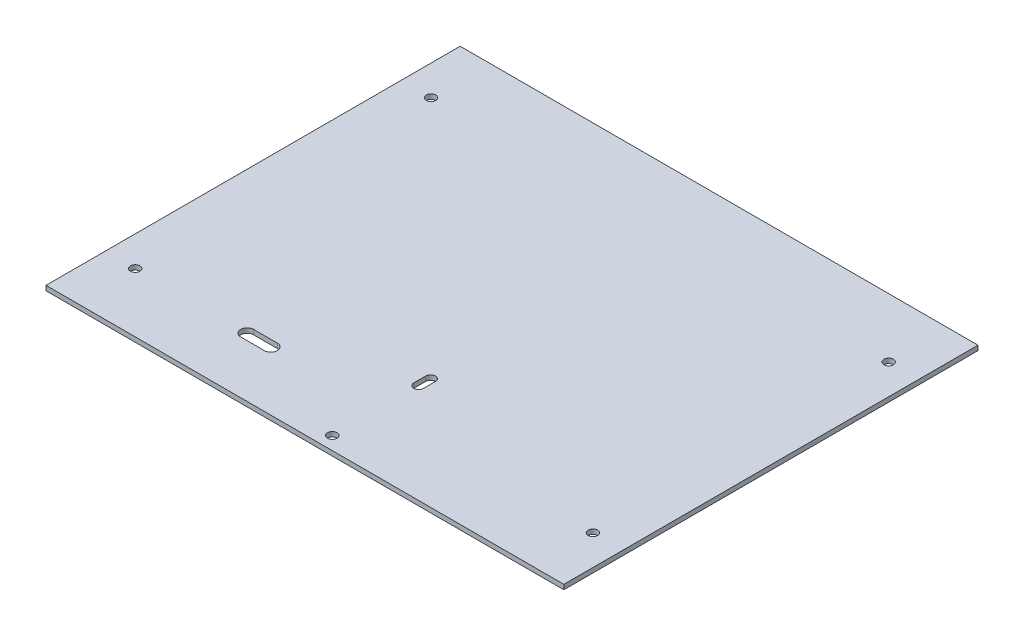
ISO-10303-21;
HEADER;
FILE_DESCRIPTION(('STEP AP214'),'2;1');
FILE_NAME('part.step','',(''),(''),'','','');
FILE_SCHEMA(('AUTOMOTIVE_DESIGN { 1 0 10303 214 1 1 1 1 }'));
ENDSEC;
DATA;
#1=APPLICATION_CONTEXT('core data for automotive mechanical design processes');
#2=APPLICATION_PROTOCOL_DEFINITION('international standard','automotive_design',2000,#1);
#3=PRODUCT_CONTEXT('',#1,'mechanical');
#4=PRODUCT('Part','Part','',(#3));
#5=PRODUCT_RELATED_PRODUCT_CATEGORY('part','',(#4));
#6=PRODUCT_DEFINITION_FORMATION('','',#4);
#7=PRODUCT_DEFINITION_CONTEXT('part definition',#1,'design');
#8=PRODUCT_DEFINITION('design','',#6,#7);
#9=PRODUCT_DEFINITION_SHAPE('','',#8);
#10=(LENGTH_UNIT() NAMED_UNIT(*) SI_UNIT(.MILLI.,.METRE.));
#11=(NAMED_UNIT(*) PLANE_ANGLE_UNIT() SI_UNIT($,.RADIAN.));
#12=(NAMED_UNIT(*) SI_UNIT($,.STERADIAN.) SOLID_ANGLE_UNIT());
#13=UNCERTAINTY_MEASURE_WITH_UNIT(LENGTH_MEASURE(1.E-05),#10,'distance_accuracy_value','');
#14=(GEOMETRIC_REPRESENTATION_CONTEXT(3) GLOBAL_UNCERTAINTY_ASSIGNED_CONTEXT((#13)) GLOBAL_UNIT_ASSIGNED_CONTEXT((#10,
#11,#12)) REPRESENTATION_CONTEXT('',''));
#15=CARTESIAN_POINT('',(0.,0.,0.));
#16=DIRECTION('',(0.,0.,1.));
#17=DIRECTION('',(1.,0.,0.));
#18=AXIS2_PLACEMENT_3D('',#15,#16,#17);
#19=CARTESIAN_POINT('',(0.,4.,0.));
#20=DIRECTION('',(0.,-1.,0.));
#21=DIRECTION('',(0.,0.,-1.));
#22=AXIS2_PLACEMENT_3D('',#19,#20,#21);
#23=PLANE('',#22);
#24=CARTESIAN_POINT('',(-193.4,4.,125.));
#25=DIRECTION('',(0.,1.,0.));
#26=DIRECTION('',(0.,0.,1.));
#27=AXIS2_PLACEMENT_3D('',#24,#25,#26);
#28=CIRCLE('',#27,3.99999999999999);
#29=CARTESIAN_POINT('',(-193.4,4.,129.));
#30=VERTEX_POINT('',#29);
#31=EDGE_CURVE('E177',#30,#30,#28,.T.);
#32=ORIENTED_EDGE('',*,*,#31,.F.);
#33=EDGE_LOOP('',(#32));
#34=FACE_BOUND('',#33,.T.);
#35=CARTESIAN_POINT('',(193.4,4.,125.));
#36=DIRECTION('',(0.,1.,0.));
#37=DIRECTION('',(0.,0.,-1.));
#38=AXIS2_PLACEMENT_3D('',#35,#36,#37);
#39=CIRCLE('',#38,3.99999999999999);
#40=CARTESIAN_POINT('',(193.4,4.,121.));
#41=VERTEX_POINT('',#40);
#42=EDGE_CURVE('E186',#41,#41,#39,.T.);
#43=ORIENTED_EDGE('',*,*,#42,.F.);
#44=EDGE_LOOP('',(#43));
#45=FACE_BOUND('',#44,.T.);
#46=CARTESIAN_POINT('',(193.4,4.,-125.));
#47=DIRECTION('',(0.,1.,0.));
#48=DIRECTION('',(0.,0.,-1.));
#49=AXIS2_PLACEMENT_3D('',#46,#47,#48);
#50=CIRCLE('',#49,3.99999999999999);
#51=CARTESIAN_POINT('',(193.4,4.,-129.));
#52=VERTEX_POINT('',#51);
#53=EDGE_CURVE('E160',#52,#52,#50,.T.);
#54=ORIENTED_EDGE('',*,*,#53,.F.);
#55=EDGE_LOOP('',(#54));
#56=FACE_BOUND('',#55,.T.);
#57=DIRECTION('',(1.,0.,0.));
#58=VECTOR('',#57,1.);
#59=CARTESIAN_POINT('',(-98.8,4.,130.5));
#60=LINE('',#59,#58);
#61=CARTESIAN_POINT('',(-98.8,4.,130.5));
#62=VERTEX_POINT('',#61);
#63=CARTESIAN_POINT('',(-78.8000000000001,4.,130.5));
#64=VERTEX_POINT('',#63);
#65=EDGE_CURVE('E152',#62,#64,#60,.T.);
#66=ORIENTED_EDGE('',*,*,#65,.F.);
#67=CARTESIAN_POINT('',(-98.8,4.,125.));
#68=DIRECTION('',(0.,1.,0.));
#69=DIRECTION('',(0.,0.,1.));
#70=AXIS2_PLACEMENT_3D('',#67,#68,#69);
#71=CIRCLE('',#70,5.50000000000001);
#72=CARTESIAN_POINT('',(-98.8,4.,119.5));
#73=VERTEX_POINT('',#72);
#74=EDGE_CURVE('E57',#73,#62,#71,.T.);
#75=ORIENTED_EDGE('',*,*,#74,.F.);
#76=DIRECTION('',(-1.,0.,0.));
#77=VECTOR('',#76,1.);
#78=CARTESIAN_POINT('',(-98.8,4.,119.5));
#79=LINE('',#78,#77);
#80=CARTESIAN_POINT('',(-78.8000000000001,4.,119.5));
#81=VERTEX_POINT('',#80);
#82=EDGE_CURVE('E141',#81,#73,#79,.T.);
#83=ORIENTED_EDGE('',*,*,#82,.F.);
#84=CARTESIAN_POINT('',(-78.8000000000001,4.,125.));
#85=DIRECTION('',(0.,1.,0.));
#86=DIRECTION('',(0.,0.,1.));
#87=AXIS2_PLACEMENT_3D('',#84,#85,#86);
#88=CIRCLE('',#87,5.50000000000001);
#89=EDGE_CURVE('E147',#64,#81,#88,.T.);
#90=ORIENTED_EDGE('',*,*,#89,.F.);
#91=EDGE_LOOP('',(#66,#75,#83,#90));
#92=FACE_BOUND('',#91,.T.);
#93=CARTESIAN_POINT('',(-193.4,4.,-125.));
#94=DIRECTION('',(0.,1.,0.));
#95=DIRECTION('',(0.,0.,1.));
#96=AXIS2_PLACEMENT_3D('',#93,#94,#95);
#97=CIRCLE('',#96,3.99999999999999);
#98=CARTESIAN_POINT('',(-193.4,4.,-121.));
#99=VERTEX_POINT('',#98);
#100=EDGE_CURVE('E181',#99,#99,#97,.T.);
#101=ORIENTED_EDGE('',*,*,#100,.F.);
#102=EDGE_LOOP('',(#101));
#103=FACE_BOUND('',#102,.T.);
#104=CARTESIAN_POINT('',(12.0439999999759,4.,163.887499999985));
#105=DIRECTION('',(0.,1.,0.));
#106=DIRECTION('',(0.,0.,1.));
#107=AXIS2_PLACEMENT_3D('',#104,#105,#106);
#108=CIRCLE('',#107,4.06400000002691);
#109=CARTESIAN_POINT('',(12.0439999999759,4.,167.951500000012));
#110=VERTEX_POINT('',#109);
#111=EDGE_CURVE('E245',#110,#110,#108,.T.);
#112=ORIENTED_EDGE('',*,*,#111,.F.);
#113=EDGE_LOOP('',(#112));
#114=FACE_BOUND('',#113,.T.);
#115=DIRECTION('',(0.,0.,1.));
#116=VECTOR('',#115,1.);
#117=CARTESIAN_POINT('',(-218.8,4.,-175.));
#118=LINE('',#117,#116);
#119=CARTESIAN_POINT('',(-218.8,4.,-175.));
#120=VERTEX_POINT('',#119);
#121=CARTESIAN_POINT('',(-218.8,4.,175.));
#122=VERTEX_POINT('',#121);
#123=EDGE_CURVE('E253',#120,#122,#118,.T.);
#124=ORIENTED_EDGE('',*,*,#123,.T.);
#125=DIRECTION('',(1.,0.,0.));
#126=VECTOR('',#125,1.);
#127=CARTESIAN_POINT('',(218.8,4.,175.));
#128=LINE('',#127,#126);
#129=CARTESIAN_POINT('',(218.8,4.,175.));
#130=VERTEX_POINT('',#129);
#131=EDGE_CURVE('E257',#122,#130,#128,.T.);
#132=ORIENTED_EDGE('',*,*,#131,.T.);
#133=DIRECTION('',(0.,0.,-1.));
#134=VECTOR('',#133,1.);
#135=CARTESIAN_POINT('',(218.8,4.,-175.));
#136=LINE('',#135,#134);
#137=CARTESIAN_POINT('',(218.8,4.,-175.));
#138=VERTEX_POINT('',#137);
#139=EDGE_CURVE('E261',#130,#138,#136,.T.);
#140=ORIENTED_EDGE('',*,*,#139,.T.);
#141=DIRECTION('',(-1.,0.,0.));
#142=VECTOR('',#141,1.);
#143=CARTESIAN_POINT('',(218.8,4.,-175.));
#144=LINE('',#143,#142);
#145=EDGE_CURVE('E264',#138,#120,#144,.T.);
#146=ORIENTED_EDGE('',*,*,#145,.T.);
#147=EDGE_LOOP('',(#124,#132,#140,#146));
#148=FACE_BOUND('',#147,.T.);
#149=CARTESIAN_POINT('',(12.0440000000233,4.,90.8874999999855));
#150=DIRECTION('',(0.,1.,0.));
#151=DIRECTION('',(0.,0.,1.));
#152=AXIS2_PLACEMENT_3D('',#149,#150,#151);
#153=CIRCLE('',#152,4.065);
#154=CARTESIAN_POINT('',(7.97900000002329,4.,90.8874999999855));
#155=VERTEX_POINT('',#154);
#156=CARTESIAN_POINT('',(16.1090000000233,4.,90.8874999999855));
#157=VERTEX_POINT('',#156);
#158=EDGE_CURVE('E202',#155,#157,#153,.T.);
#159=ORIENTED_EDGE('',*,*,#158,.F.);
#160=DIRECTION('',(0.,0.,1.));
#161=VECTOR('',#160,1.);
#162=CARTESIAN_POINT('',(7.97900000002329,4.,90.8874999999855));
#163=LINE('',#162,#161);
#164=CARTESIAN_POINT('',(7.97900000002329,4.,80.8874999999854));
#165=VERTEX_POINT('',#164);
#166=EDGE_CURVE('E213',#165,#155,#163,.T.);
#167=ORIENTED_EDGE('',*,*,#166,.F.);
#168=CARTESIAN_POINT('',(12.0440000000233,4.,80.8874999999854));
#169=DIRECTION('',(0.,1.,0.));
#170=DIRECTION('',(0.,0.,1.));
#171=AXIS2_PLACEMENT_3D('',#168,#169,#170);
#172=CIRCLE('',#171,4.065);
#173=CARTESIAN_POINT('',(16.1090000000233,4.,80.8874999999854));
#174=VERTEX_POINT('',#173);
#175=EDGE_CURVE('E209',#174,#165,#172,.T.);
#176=ORIENTED_EDGE('',*,*,#175,.F.);
#177=DIRECTION('',(0.,0.,-1.));
#178=VECTOR('',#177,1.);
#179=CARTESIAN_POINT('',(16.1090000000233,4.,90.8874999999855));
#180=LINE('',#179,#178);
#181=EDGE_CURVE('E205',#157,#174,#180,.T.);
#182=ORIENTED_EDGE('',*,*,#181,.F.);
#183=EDGE_LOOP('',(#159,#167,#176,#182));
#184=FACE_BOUND('',#183,.T.);
#185=ADVANCED_FACE('F41',(#34,#45,#56,#92,#103,#114,#148,#184),#23,.F.);
#186=CARTESIAN_POINT('',(0.,0.,0.));
#187=DIRECTION('',(0.,-1.,0.));
#188=DIRECTION('',(0.,0.,-1.));
#189=AXIS2_PLACEMENT_3D('',#186,#187,#188);
#190=PLANE('',#189);
#191=CARTESIAN_POINT('',(-193.4,0.,125.));
#192=DIRECTION('',(0.,1.,0.));
#193=DIRECTION('',(0.,0.,1.));
#194=AXIS2_PLACEMENT_3D('',#191,#192,#193);
#195=CIRCLE('',#194,3.99999999999999);
#196=CARTESIAN_POINT('',(-193.4,0.,129.));
#197=VERTEX_POINT('',#196);
#198=EDGE_CURVE('E182',#197,#197,#195,.T.);
#199=ORIENTED_EDGE('',*,*,#198,.T.);
#200=EDGE_LOOP('',(#199));
#201=FACE_BOUND('',#200,.T.);
#202=CARTESIAN_POINT('',(193.4,0.,125.));
#203=DIRECTION('',(0.,1.,0.));
#204=DIRECTION('',(0.,0.,-1.));
#205=AXIS2_PLACEMENT_3D('',#202,#203,#204);
#206=CIRCLE('',#205,3.99999999999999);
#207=CARTESIAN_POINT('',(193.4,0.,121.));
#208=VERTEX_POINT('',#207);
#209=EDGE_CURVE('E190',#208,#208,#206,.T.);
#210=ORIENTED_EDGE('',*,*,#209,.T.);
#211=EDGE_LOOP('',(#210));
#212=FACE_BOUND('',#211,.T.);
#213=CARTESIAN_POINT('',(193.4,0.,-125.));
#214=DIRECTION('',(0.,1.,0.));
#215=DIRECTION('',(0.,0.,-1.));
#216=AXIS2_PLACEMENT_3D('',#213,#214,#215);
#217=CIRCLE('',#216,3.99999999999999);
#218=CARTESIAN_POINT('',(193.4,0.,-129.));
#219=VERTEX_POINT('',#218);
#220=EDGE_CURVE('E154',#219,#219,#217,.T.);
#221=ORIENTED_EDGE('',*,*,#220,.T.);
#222=EDGE_LOOP('',(#221));
#223=FACE_BOUND('',#222,.T.);
#224=CARTESIAN_POINT('',(-98.8,0.,125.));
#225=DIRECTION('',(0.,1.,0.));
#226=DIRECTION('',(0.,0.,1.));
#227=AXIS2_PLACEMENT_3D('',#224,#225,#226);
#228=CIRCLE('',#227,5.50000000000001);
#229=CARTESIAN_POINT('',(-98.8,0.,119.5));
#230=VERTEX_POINT('',#229);
#231=CARTESIAN_POINT('',(-98.8,0.,130.5));
#232=VERTEX_POINT('',#231);
#233=EDGE_CURVE('E133',#230,#232,#228,.T.);
#234=ORIENTED_EDGE('',*,*,#233,.T.);
#235=DIRECTION('',(1.,0.,0.));
#236=VECTOR('',#235,1.);
#237=CARTESIAN_POINT('',(-98.8,0.,130.5));
#238=LINE('',#237,#236);
#239=CARTESIAN_POINT('',(-78.8000000000001,0.,130.5));
#240=VERTEX_POINT('',#239);
#241=EDGE_CURVE('E171',#232,#240,#238,.T.);
#242=ORIENTED_EDGE('',*,*,#241,.T.);
#243=CARTESIAN_POINT('',(-78.8000000000001,0.,125.));
#244=DIRECTION('',(0.,1.,0.));
#245=DIRECTION('',(0.,0.,1.));
#246=AXIS2_PLACEMENT_3D('',#243,#244,#245);
#247=CIRCLE('',#246,5.50000000000001);
#248=CARTESIAN_POINT('',(-78.8000000000001,0.,119.5));
#249=VERTEX_POINT('',#248);
#250=EDGE_CURVE('E65',#240,#249,#247,.T.);
#251=ORIENTED_EDGE('',*,*,#250,.T.);
#252=DIRECTION('',(-1.,0.,0.));
#253=VECTOR('',#252,1.);
#254=CARTESIAN_POINT('',(-98.8,0.,119.5));
#255=LINE('',#254,#253);
#256=EDGE_CURVE('E165',#249,#230,#255,.T.);
#257=ORIENTED_EDGE('',*,*,#256,.T.);
#258=EDGE_LOOP('',(#234,#242,#251,#257));
#259=FACE_BOUND('',#258,.T.);
#260=CARTESIAN_POINT('',(-193.4,0.,-125.));
#261=DIRECTION('',(0.,1.,0.));
#262=DIRECTION('',(0.,0.,1.));
#263=AXIS2_PLACEMENT_3D('',#260,#261,#262);
#264=CIRCLE('',#263,3.99999999999999);
#265=CARTESIAN_POINT('',(-193.4,0.,-121.));
#266=VERTEX_POINT('',#265);
#267=EDGE_CURVE('E194',#266,#266,#264,.T.);
#268=ORIENTED_EDGE('',*,*,#267,.T.);
#269=EDGE_LOOP('',(#268));
#270=FACE_BOUND('',#269,.T.);
#271=DIRECTION('',(0.,0.,1.));
#272=VECTOR('',#271,1.);
#273=CARTESIAN_POINT('',(-218.8,0.,-175.));
#274=LINE('',#273,#272);
#275=CARTESIAN_POINT('',(-218.8,0.,-175.));
#276=VERTEX_POINT('',#275);
#277=CARTESIAN_POINT('',(-218.8,0.,175.));
#278=VERTEX_POINT('',#277);
#279=EDGE_CURVE('E249',#276,#278,#274,.T.);
#280=ORIENTED_EDGE('',*,*,#279,.F.);
#281=DIRECTION('',(-1.,0.,0.));
#282=VECTOR('',#281,1.);
#283=CARTESIAN_POINT('',(218.8,0.,-175.));
#284=LINE('',#283,#282);
#285=CARTESIAN_POINT('',(218.8,0.,-175.));
#286=VERTEX_POINT('',#285);
#287=EDGE_CURVE('E258',#286,#276,#284,.T.);
#288=ORIENTED_EDGE('',*,*,#287,.F.);
#289=DIRECTION('',(0.,0.,-1.));
#290=VECTOR('',#289,1.);
#291=CARTESIAN_POINT('',(218.8,0.,-175.));
#292=LINE('',#291,#290);
#293=CARTESIAN_POINT('',(218.8,0.,175.));
#294=VERTEX_POINT('',#293);
#295=EDGE_CURVE('E274',#294,#286,#292,.T.);
#296=ORIENTED_EDGE('',*,*,#295,.F.);
#297=DIRECTION('',(1.,0.,0.));
#298=VECTOR('',#297,1.);
#299=CARTESIAN_POINT('',(218.8,0.,175.));
#300=LINE('',#299,#298);
#301=EDGE_CURVE('E271',#278,#294,#300,.T.);
#302=ORIENTED_EDGE('',*,*,#301,.F.);
#303=EDGE_LOOP('',(#280,#288,#296,#302));
#304=FACE_BOUND('',#303,.T.);
#305=CARTESIAN_POINT('',(12.0439999999759,0.,163.887499999985));
#306=DIRECTION('',(0.,1.,0.));
#307=DIRECTION('',(0.,0.,1.));
#308=AXIS2_PLACEMENT_3D('',#305,#306,#307);
#309=CIRCLE('',#308,4.06400000002691);
#310=CARTESIAN_POINT('',(12.0439999999759,0.,167.951500000012));
#311=VERTEX_POINT('',#310);
#312=EDGE_CURVE('E244',#311,#311,#309,.T.);
#313=ORIENTED_EDGE('',*,*,#312,.T.);
#314=EDGE_LOOP('',(#313));
#315=FACE_BOUND('',#314,.T.);
#316=DIRECTION('',(0.,0.,1.));
#317=VECTOR('',#316,1.);
#318=CARTESIAN_POINT('',(7.97900000002329,0.,90.8874999999855));
#319=LINE('',#318,#317);
#320=CARTESIAN_POINT('',(7.97900000002329,0.,80.8874999999854));
#321=VERTEX_POINT('',#320);
#322=CARTESIAN_POINT('',(7.97900000002329,0.,90.8874999999855));
#323=VERTEX_POINT('',#322);
#324=EDGE_CURVE('E206',#321,#323,#319,.T.);
#325=ORIENTED_EDGE('',*,*,#324,.T.);
#326=CARTESIAN_POINT('',(12.0440000000233,0.,90.8874999999855));
#327=DIRECTION('',(0.,1.,0.));
#328=DIRECTION('',(0.,0.,1.));
#329=AXIS2_PLACEMENT_3D('',#326,#327,#328);
#330=CIRCLE('',#329,4.065);
#331=CARTESIAN_POINT('',(16.1090000000233,0.,90.8874999999855));
#332=VERTEX_POINT('',#331);
#333=EDGE_CURVE('E198',#323,#332,#330,.T.);
#334=ORIENTED_EDGE('',*,*,#333,.T.);
#335=DIRECTION('',(0.,0.,-1.));
#336=VECTOR('',#335,1.);
#337=CARTESIAN_POINT('',(16.1090000000233,0.,90.8874999999855));
#338=LINE('',#337,#336);
#339=CARTESIAN_POINT('',(16.1090000000233,0.,80.8874999999854));
#340=VERTEX_POINT('',#339);
#341=EDGE_CURVE('E220',#332,#340,#338,.T.);
#342=ORIENTED_EDGE('',*,*,#341,.T.);
#343=CARTESIAN_POINT('',(12.0440000000233,0.,80.8874999999854));
#344=DIRECTION('',(0.,1.,0.));
#345=DIRECTION('',(0.,0.,1.));
#346=AXIS2_PLACEMENT_3D('',#343,#344,#345);
#347=CIRCLE('',#346,4.065);
#348=EDGE_CURVE('E224',#340,#321,#347,.T.);
#349=ORIENTED_EDGE('',*,*,#348,.T.);
#350=EDGE_LOOP('',(#325,#334,#342,#349));
#351=FACE_BOUND('',#350,.T.);
#352=ADVANCED_FACE('F298',(#201,#212,#223,#259,#270,#304,#315,#351),#190,.T.);
#353=CARTESIAN_POINT('',(-218.8,4.,-175.));
#354=DIRECTION('',(1.,0.,0.));
#355=DIRECTION('',(0.,0.,-1.));
#356=AXIS2_PLACEMENT_3D('',#353,#354,#355);
#357=PLANE('',#356);
#358=ORIENTED_EDGE('',*,*,#279,.T.);
#359=DIRECTION('',(0.,-1.,0.));
#360=VECTOR('',#359,1.);
#361=CARTESIAN_POINT('',(-218.8,4.,175.));
#362=LINE('',#361,#360);
#363=EDGE_CURVE('E11',#122,#278,#362,.T.);
#364=ORIENTED_EDGE('',*,*,#363,.F.);
#365=ORIENTED_EDGE('',*,*,#123,.F.);
#366=DIRECTION('',(0.,-1.,0.));
#367=VECTOR('',#366,1.);
#368=CARTESIAN_POINT('',(-218.8,4.,-175.));
#369=LINE('',#368,#367);
#370=EDGE_CURVE('E267',#120,#276,#369,.T.);
#371=ORIENTED_EDGE('',*,*,#370,.T.);
#372=EDGE_LOOP('',(#358,#364,#365,#371));
#373=FACE_BOUND('',#372,.T.);
#374=ADVANCED_FACE('F43',(#373),#357,.F.);
#375=CARTESIAN_POINT('',(218.8,4.,175.));
#376=DIRECTION('',(0.,0.,-1.));
#377=DIRECTION('',(-1.,0.,0.));
#378=AXIS2_PLACEMENT_3D('',#375,#376,#377);
#379=PLANE('',#378);
#380=ORIENTED_EDGE('',*,*,#301,.T.);
#381=DIRECTION('',(0.,-1.,0.));
#382=VECTOR('',#381,1.);
#383=CARTESIAN_POINT('',(218.8,4.,175.));
#384=LINE('',#383,#382);
#385=EDGE_CURVE('E50',#130,#294,#384,.T.);
#386=ORIENTED_EDGE('',*,*,#385,.F.);
#387=ORIENTED_EDGE('',*,*,#131,.F.);
#388=ORIENTED_EDGE('',*,*,#363,.T.);
#389=EDGE_LOOP('',(#380,#386,#387,#388));
#390=FACE_BOUND('',#389,.T.);
#391=ADVANCED_FACE('F309',(#390),#379,.F.);
#392=CARTESIAN_POINT('',(218.8,4.,-175.));
#393=DIRECTION('',(-1.,0.,0.));
#394=DIRECTION('',(0.,0.,1.));
#395=AXIS2_PLACEMENT_3D('',#392,#393,#394);
#396=PLANE('',#395);
#397=ORIENTED_EDGE('',*,*,#295,.T.);
#398=DIRECTION('',(0.,-1.,0.));
#399=VECTOR('',#398,1.);
#400=CARTESIAN_POINT('',(218.8,4.,-175.));
#401=LINE('',#400,#399);
#402=EDGE_CURVE('E282',#138,#286,#401,.T.);
#403=ORIENTED_EDGE('',*,*,#402,.F.);
#404=ORIENTED_EDGE('',*,*,#139,.F.);
#405=ORIENTED_EDGE('',*,*,#385,.T.);
#406=EDGE_LOOP('',(#397,#403,#404,#405));
#407=FACE_BOUND('',#406,.T.);
#408=ADVANCED_FACE('F292',(#407),#396,.F.);
#409=CARTESIAN_POINT('',(218.8,4.,-175.));
#410=DIRECTION('',(0.,0.,1.));
#411=DIRECTION('',(1.,0.,0.));
#412=AXIS2_PLACEMENT_3D('',#409,#410,#411);
#413=PLANE('',#412);
#414=ORIENTED_EDGE('',*,*,#287,.T.);
#415=ORIENTED_EDGE('',*,*,#370,.F.);
#416=ORIENTED_EDGE('',*,*,#145,.F.);
#417=ORIENTED_EDGE('',*,*,#402,.T.);
#418=EDGE_LOOP('',(#414,#415,#416,#417));
#419=FACE_BOUND('',#418,.T.);
#420=ADVANCED_FACE('F302',(#419),#413,.F.);
#421=CARTESIAN_POINT('',(12.0439999999759,4.,163.887499999985));
#422=DIRECTION('',(0.,-1.,0.));
#423=DIRECTION('',(0.,0.,-1.));
#424=AXIS2_PLACEMENT_3D('',#421,#422,#423);
#425=CYLINDRICAL_SURFACE('',#424,4.06400000002691);
#426=ORIENTED_EDGE('',*,*,#111,.T.);
#427=EDGE_LOOP('',(#426));
#428=FACE_BOUND('',#427,.T.);
#429=ORIENTED_EDGE('',*,*,#312,.F.);
#430=EDGE_LOOP('',(#429));
#431=FACE_BOUND('',#430,.T.);
#432=ADVANCED_FACE('F328',(#428,#431),#425,.F.);
#433=CARTESIAN_POINT('',(12.0440000000233,4.,90.8874999999855));
#434=DIRECTION('',(0.,-1.,0.));
#435=DIRECTION('',(0.,0.,-1.));
#436=AXIS2_PLACEMENT_3D('',#433,#434,#435);
#437=CYLINDRICAL_SURFACE('',#436,4.065);
#438=ORIENTED_EDGE('',*,*,#333,.F.);
#439=DIRECTION('',(0.,-1.,0.));
#440=VECTOR('',#439,1.);
#441=CARTESIAN_POINT('',(7.97900000002329,4.,90.8874999999855));
#442=LINE('',#441,#440);
#443=EDGE_CURVE('E216',#155,#323,#442,.T.);
#444=ORIENTED_EDGE('',*,*,#443,.F.);
#445=ORIENTED_EDGE('',*,*,#158,.T.);
#446=DIRECTION('',(0.,-1.,0.));
#447=VECTOR('',#446,1.);
#448=CARTESIAN_POINT('',(16.1090000000233,4.,90.8874999999855));
#449=LINE('',#448,#447);
#450=EDGE_CURVE('E240',#157,#332,#449,.T.);
#451=ORIENTED_EDGE('',*,*,#450,.T.);
#452=EDGE_LOOP('',(#438,#444,#445,#451));
#453=FACE_BOUND('',#452,.T.);
#454=ADVANCED_FACE('F335',(#453),#437,.F.);
#455=CARTESIAN_POINT('',(16.1090000000233,4.,90.8874999999855));
#456=DIRECTION('',(-1.,0.,0.));
#457=DIRECTION('',(0.,0.,1.));
#458=AXIS2_PLACEMENT_3D('',#455,#456,#457);
#459=PLANE('',#458);
#460=ORIENTED_EDGE('',*,*,#341,.F.);
#461=ORIENTED_EDGE('',*,*,#450,.F.);
#462=ORIENTED_EDGE('',*,*,#181,.T.);
#463=DIRECTION('',(0.,-1.,0.));
#464=VECTOR('',#463,1.);
#465=CARTESIAN_POINT('',(16.1090000000233,4.,80.8874999999854));
#466=LINE('',#465,#464);
#467=EDGE_CURVE('E237',#174,#340,#466,.T.);
#468=ORIENTED_EDGE('',*,*,#467,.T.);
#469=EDGE_LOOP('',(#460,#461,#462,#468));
#470=FACE_BOUND('',#469,.T.);
#471=ADVANCED_FACE('F340',(#470),#459,.T.);
#472=CARTESIAN_POINT('',(12.0440000000233,4.,80.8874999999854));
#473=DIRECTION('',(0.,-1.,0.));
#474=DIRECTION('',(0.,0.,-1.));
#475=AXIS2_PLACEMENT_3D('',#472,#473,#474);
#476=CYLINDRICAL_SURFACE('',#475,4.065);
#477=ORIENTED_EDGE('',*,*,#348,.F.);
#478=ORIENTED_EDGE('',*,*,#467,.F.);
#479=ORIENTED_EDGE('',*,*,#175,.T.);
#480=DIRECTION('',(0.,-1.,0.));
#481=VECTOR('',#480,1.);
#482=CARTESIAN_POINT('',(7.97900000002329,4.,80.8874999999854));
#483=LINE('',#482,#481);
#484=EDGE_CURVE('E234',#165,#321,#483,.T.);
#485=ORIENTED_EDGE('',*,*,#484,.T.);
#486=EDGE_LOOP('',(#477,#478,#479,#485));
#487=FACE_BOUND('',#486,.T.);
#488=ADVANCED_FACE('F359',(#487),#476,.F.);
#489=CARTESIAN_POINT('',(7.97900000002329,4.,90.8874999999855));
#490=DIRECTION('',(1.,0.,0.));
#491=DIRECTION('',(0.,0.,-1.));
#492=AXIS2_PLACEMENT_3D('',#489,#490,#491);
#493=PLANE('',#492);
#494=ORIENTED_EDGE('',*,*,#324,.F.);
#495=ORIENTED_EDGE('',*,*,#484,.F.);
#496=ORIENTED_EDGE('',*,*,#166,.T.);
#497=ORIENTED_EDGE('',*,*,#443,.T.);
#498=EDGE_LOOP('',(#494,#495,#496,#497));
#499=FACE_BOUND('',#498,.T.);
#500=ADVANCED_FACE('F349',(#499),#493,.T.);
#501=CARTESIAN_POINT('',(-193.4,0.,-125.));
#502=DIRECTION('',(0.,1.,0.));
#503=DIRECTION('',(0.,0.,1.));
#504=AXIS2_PLACEMENT_3D('',#501,#502,#503);
#505=CYLINDRICAL_SURFACE('',#504,3.99999999999999);
#506=ORIENTED_EDGE('',*,*,#267,.F.);
#507=EDGE_LOOP('',(#506));
#508=FACE_BOUND('',#507,.T.);
#509=ORIENTED_EDGE('',*,*,#100,.T.);
#510=EDGE_LOOP('',(#509));
#511=FACE_BOUND('',#510,.T.);
#512=ADVANCED_FACE('F365',(#508,#511),#505,.F.);
#513=CARTESIAN_POINT('',(-98.8,0.,125.));
#514=DIRECTION('',(0.,1.,0.));
#515=DIRECTION('',(0.,0.,1.));
#516=AXIS2_PLACEMENT_3D('',#513,#514,#515);
#517=CYLINDRICAL_SURFACE('',#516,5.50000000000001);
#518=ORIENTED_EDGE('',*,*,#74,.T.);
#519=DIRECTION('',(0.,1.,0.));
#520=VECTOR('',#519,1.);
#521=CARTESIAN_POINT('',(-98.8,0.,130.5));
#522=LINE('',#521,#520);
#523=EDGE_CURVE('E168',#232,#62,#522,.T.);
#524=ORIENTED_EDGE('',*,*,#523,.F.);
#525=ORIENTED_EDGE('',*,*,#233,.F.);
#526=DIRECTION('',(0.,1.,0.));
#527=VECTOR('',#526,1.);
#528=CARTESIAN_POINT('',(-98.8,0.,119.5));
#529=LINE('',#528,#527);
#530=EDGE_CURVE('E129',#230,#73,#529,.T.);
#531=ORIENTED_EDGE('',*,*,#530,.T.);
#532=EDGE_LOOP('',(#518,#524,#525,#531));
#533=FACE_BOUND('',#532,.T.);
#534=ADVANCED_FACE('F131',(#533),#517,.F.);
#535=CARTESIAN_POINT('',(-98.8,0.,119.5));
#536=DIRECTION('',(0.,0.,-1.));
#537=DIRECTION('',(-1.,0.,0.));
#538=AXIS2_PLACEMENT_3D('',#535,#536,#537);
#539=PLANE('',#538);
#540=ORIENTED_EDGE('',*,*,#82,.T.);
#541=ORIENTED_EDGE('',*,*,#530,.F.);
#542=ORIENTED_EDGE('',*,*,#256,.F.);
#543=DIRECTION('',(0.,1.,0.));
#544=VECTOR('',#543,1.);
#545=CARTESIAN_POINT('',(-78.8000000000001,0.,119.5));
#546=LINE('',#545,#544);
#547=EDGE_CURVE('E138',#249,#81,#546,.T.);
#548=ORIENTED_EDGE('',*,*,#547,.T.);
#549=EDGE_LOOP('',(#540,#541,#542,#548));
#550=FACE_BOUND('',#549,.T.);
#551=ADVANCED_FACE('F142',(#550),#539,.F.);
#552=CARTESIAN_POINT('',(-78.8000000000001,0.,125.));
#553=DIRECTION('',(0.,1.,0.));
#554=DIRECTION('',(0.,0.,1.));
#555=AXIS2_PLACEMENT_3D('',#552,#553,#554);
#556=CYLINDRICAL_SURFACE('',#555,5.50000000000001);
#557=ORIENTED_EDGE('',*,*,#89,.T.);
#558=ORIENTED_EDGE('',*,*,#547,.F.);
#559=ORIENTED_EDGE('',*,*,#250,.F.);
#560=DIRECTION('',(0.,1.,0.));
#561=VECTOR('',#560,1.);
#562=CARTESIAN_POINT('',(-78.8000000000001,0.,130.5));
#563=LINE('',#562,#561);
#564=EDGE_CURVE('E407',#240,#64,#563,.T.);
#565=ORIENTED_EDGE('',*,*,#564,.T.);
#566=EDGE_LOOP('',(#557,#558,#559,#565));
#567=FACE_BOUND('',#566,.T.);
#568=ADVANCED_FACE('F383',(#567),#556,.F.);
#569=CARTESIAN_POINT('',(-98.8,0.,130.5));
#570=DIRECTION('',(0.,0.,1.));
#571=DIRECTION('',(1.,0.,0.));
#572=AXIS2_PLACEMENT_3D('',#569,#570,#571);
#573=PLANE('',#572);
#574=ORIENTED_EDGE('',*,*,#65,.T.);
#575=ORIENTED_EDGE('',*,*,#564,.F.);
#576=ORIENTED_EDGE('',*,*,#241,.F.);
#577=ORIENTED_EDGE('',*,*,#523,.T.);
#578=EDGE_LOOP('',(#574,#575,#576,#577));
#579=FACE_BOUND('',#578,.T.);
#580=ADVANCED_FACE('F386',(#579),#573,.F.);
#581=CARTESIAN_POINT('',(193.4,0.,-125.));
#582=DIRECTION('',(0.,1.,0.));
#583=DIRECTION('',(0.,0.,1.));
#584=AXIS2_PLACEMENT_3D('',#581,#582,#583);
#585=CYLINDRICAL_SURFACE('',#584,3.99999999999999);
#586=ORIENTED_EDGE('',*,*,#220,.F.);
#587=EDGE_LOOP('',(#586));
#588=FACE_BOUND('',#587,.T.);
#589=ORIENTED_EDGE('',*,*,#53,.T.);
#590=EDGE_LOOP('',(#589));
#591=FACE_BOUND('',#590,.T.);
#592=ADVANCED_FACE('F376',(#588,#591),#585,.F.);
#593=CARTESIAN_POINT('',(193.4,0.,125.));
#594=DIRECTION('',(0.,1.,0.));
#595=DIRECTION('',(0.,0.,1.));
#596=AXIS2_PLACEMENT_3D('',#593,#594,#595);
#597=CYLINDRICAL_SURFACE('',#596,3.99999999999999);
#598=ORIENTED_EDGE('',*,*,#209,.F.);
#599=EDGE_LOOP('',(#598));
#600=FACE_BOUND('',#599,.T.);
#601=ORIENTED_EDGE('',*,*,#42,.T.);
#602=EDGE_LOOP('',(#601));
#603=FACE_BOUND('',#602,.T.);
#604=ADVANCED_FACE('F372',(#600,#603),#597,.F.);
#605=CARTESIAN_POINT('',(-193.4,0.,125.));
#606=DIRECTION('',(0.,1.,0.));
#607=DIRECTION('',(0.,0.,1.));
#608=AXIS2_PLACEMENT_3D('',#605,#606,#607);
#609=CYLINDRICAL_SURFACE('',#608,3.99999999999999);
#610=ORIENTED_EDGE('',*,*,#198,.F.);
#611=EDGE_LOOP('',(#610));
#612=FACE_BOUND('',#611,.T.);
#613=ORIENTED_EDGE('',*,*,#31,.T.);
#614=EDGE_LOOP('',(#613));
#615=FACE_BOUND('',#614,.T.);
#616=ADVANCED_FACE('F375',(#612,#615),#609,.F.);
#617=CLOSED_SHELL('',(#185,#352,#374,#391,#408,#420,#432,#454,#471,#488,#500,#512,#534,#551,
#568,#580,#592,#604,#616));
#618=MANIFOLD_SOLID_BREP('B2',#617);
#619=ADVANCED_BREP_SHAPE_REPRESENTATION('',(#18,#618),#14);
#620=SHAPE_DEFINITION_REPRESENTATION(#9,#619);
ENDSEC;
END-ISO-10303-21;
